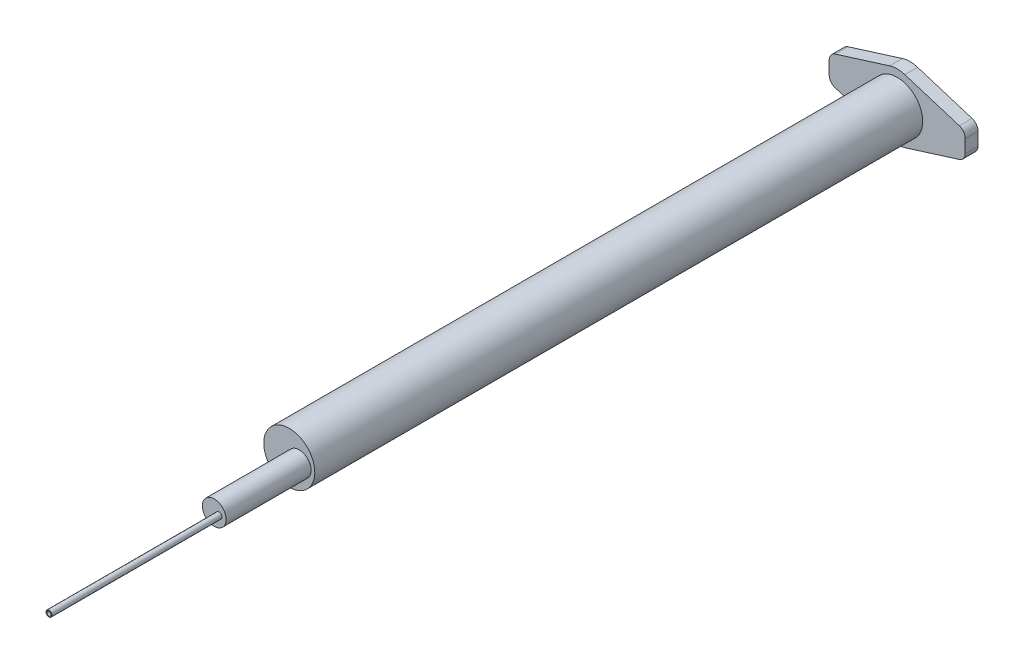
ISO-10303-21;
HEADER;
FILE_DESCRIPTION(('STEP AP214'),'2;1');
FILE_NAME('part.step','',(''),(''),'','','');
FILE_SCHEMA(('AUTOMOTIVE_DESIGN { 1 0 10303 214 1 1 1 1 }'));
ENDSEC;
DATA;
#1=APPLICATION_CONTEXT('core data for automotive mechanical design processes');
#2=APPLICATION_PROTOCOL_DEFINITION('international standard','automotive_design',2000,#1);
#3=PRODUCT_CONTEXT('',#1,'mechanical');
#4=PRODUCT('Part','Part','',(#3));
#5=PRODUCT_RELATED_PRODUCT_CATEGORY('part','',(#4));
#6=PRODUCT_DEFINITION_FORMATION('','',#4);
#7=PRODUCT_DEFINITION_CONTEXT('part definition',#1,'design');
#8=PRODUCT_DEFINITION('design','',#6,#7);
#9=PRODUCT_DEFINITION_SHAPE('','',#8);
#10=(LENGTH_UNIT() NAMED_UNIT(*) SI_UNIT(.MILLI.,.METRE.));
#11=(NAMED_UNIT(*) PLANE_ANGLE_UNIT() SI_UNIT($,.RADIAN.));
#12=(NAMED_UNIT(*) SI_UNIT($,.STERADIAN.) SOLID_ANGLE_UNIT());
#13=UNCERTAINTY_MEASURE_WITH_UNIT(LENGTH_MEASURE(1.E-05),#10,'distance_accuracy_value','');
#14=(GEOMETRIC_REPRESENTATION_CONTEXT(3) GLOBAL_UNCERTAINTY_ASSIGNED_CONTEXT((#13)) GLOBAL_UNIT_ASSIGNED_CONTEXT((#10,
#11,#12)) REPRESENTATION_CONTEXT('',''));
#15=CARTESIAN_POINT('',(0.,0.,0.));
#16=DIRECTION('',(0.,0.,1.));
#17=DIRECTION('',(1.,0.,0.));
#18=AXIS2_PLACEMENT_3D('',#15,#16,#17);
#19=CARTESIAN_POINT('',(1.17401593668525,0.,81.5));
#20=DIRECTION('',(0.,0.,1.));
#21=DIRECTION('',(1.,0.,0.));
#22=AXIS2_PLACEMENT_3D('',#19,#20,#21);
#23=PLANE('',#22);
#24=CARTESIAN_POINT('',(1.17401593668525,0.,81.5));
#25=DIRECTION('',(0.,0.,1.));
#26=DIRECTION('',(1.,0.,0.));
#27=AXIS2_PLACEMENT_3D('',#24,#25,#26);
#28=CIRCLE('',#27,1.4);
#29=CARTESIAN_POINT('',(2.57401593668525,0.,81.5));
#30=VERTEX_POINT('',#29);
#31=EDGE_CURVE('E496',#30,#30,#28,.T.);
#32=ORIENTED_EDGE('',*,*,#31,.T.);
#33=EDGE_LOOP('',(#32));
#34=FACE_BOUND('',#33,.T.);
#35=CARTESIAN_POINT('',(1.74042037950682,0.,81.5));
#36=DIRECTION('',(0.,0.,1.));
#37=DIRECTION('',(1.,0.,0.));
#38=AXIS2_PLACEMENT_3D('',#35,#36,#37);
#39=CIRCLE('',#38,0.35);
#40=CARTESIAN_POINT('',(2.09042037950682,0.,81.5));
#41=VERTEX_POINT('',#40);
#42=EDGE_CURVE('E482',#41,#41,#39,.T.);
#43=ORIENTED_EDGE('',*,*,#42,.F.);
#44=EDGE_LOOP('',(#43));
#45=FACE_BOUND('',#44,.T.);
#46=ADVANCED_FACE('F39',(#34,#45),#23,.T.);
#47=CARTESIAN_POINT('',(0.,0.,71.5));
#48=DIRECTION('',(0.,0.,1.));
#49=DIRECTION('',(1.,0.,0.));
#50=AXIS2_PLACEMENT_3D('',#47,#48,#49);
#51=PLANE('',#50);
#52=CARTESIAN_POINT('',(0.,0.,71.5));
#53=DIRECTION('',(0.,0.,1.));
#54=DIRECTION('',(1.,0.,0.));
#55=AXIS2_PLACEMENT_3D('',#52,#53,#54);
#56=CIRCLE('',#55,3.);
#57=CARTESIAN_POINT('',(3.,0.,71.5));
#58=VERTEX_POINT('',#57);
#59=EDGE_CURVE('E11',#58,#58,#56,.T.);
#60=ORIENTED_EDGE('',*,*,#59,.T.);
#61=EDGE_LOOP('',(#60));
#62=FACE_BOUND('',#61,.T.);
#63=CARTESIAN_POINT('',(1.17401593668525,0.,71.5));
#64=DIRECTION('',(0.,0.,1.));
#65=DIRECTION('',(1.,0.,0.));
#66=AXIS2_PLACEMENT_3D('',#63,#64,#65);
#67=CIRCLE('',#66,1.4);
#68=CARTESIAN_POINT('',(2.57401593668525,0.,71.5));
#69=VERTEX_POINT('',#68);
#70=EDGE_CURVE('E321',#69,#69,#67,.T.);
#71=ORIENTED_EDGE('',*,*,#70,.F.);
#72=EDGE_LOOP('',(#71));
#73=FACE_BOUND('',#72,.T.);
#74=ADVANCED_FACE('F274',(#62,#73),#51,.T.);
#75=CARTESIAN_POINT('',(0.,0.,71.5));
#76=DIRECTION('',(0.,0.,-1.));
#77=DIRECTION('',(-1.,0.,0.));
#78=AXIS2_PLACEMENT_3D('',#75,#76,#77);
#79=CYLINDRICAL_SURFACE('',#78,2.5);
#80=CARTESIAN_POINT('',(0.,0.,70.5));
#81=DIRECTION('',(0.,0.,1.));
#82=DIRECTION('',(1.,0.,0.));
#83=AXIS2_PLACEMENT_3D('',#80,#81,#82);
#84=CIRCLE('',#83,2.5);
#85=CARTESIAN_POINT('',(2.5,0.,70.5));
#86=VERTEX_POINT('',#85);
#87=EDGE_CURVE('E43',#86,#86,#84,.T.);
#88=ORIENTED_EDGE('',*,*,#87,.T.);
#89=EDGE_LOOP('',(#88));
#90=FACE_BOUND('',#89,.T.);
#91=CARTESIAN_POINT('',(0.,0.,-1.5));
#92=DIRECTION('',(0.,0.,-1.));
#93=DIRECTION('',(-1.,0.,0.));
#94=AXIS2_PLACEMENT_3D('',#91,#92,#93);
#95=CIRCLE('',#94,2.5);
#96=CARTESIAN_POINT('',(-2.5,0.,-1.5));
#97=VERTEX_POINT('',#96);
#98=EDGE_CURVE('E172',#97,#97,#95,.T.);
#99=ORIENTED_EDGE('',*,*,#98,.T.);
#100=EDGE_LOOP('',(#99));
#101=FACE_BOUND('',#100,.T.);
#102=ADVANCED_FACE('F280',(#90,#101),#79,.F.);
#103=CARTESIAN_POINT('',(0.,0.,71.5));
#104=DIRECTION('',(0.,0.,-1.));
#105=DIRECTION('',(-1.,0.,0.));
#106=AXIS2_PLACEMENT_3D('',#103,#104,#105);
#107=CYLINDRICAL_SURFACE('',#106,3.);
#108=ORIENTED_EDGE('',*,*,#59,.F.);
#109=EDGE_LOOP('',(#108));
#110=FACE_BOUND('',#109,.T.);
#111=CARTESIAN_POINT('',(0.,0.,0.));
#112=DIRECTION('',(0.,0.,1.));
#113=DIRECTION('',(1.,0.,0.));
#114=AXIS2_PLACEMENT_3D('',#111,#112,#113);
#115=CIRCLE('',#114,3.);
#116=CARTESIAN_POINT('',(3.,0.,0.));
#117=VERTEX_POINT('',#116);
#118=EDGE_CURVE('E242',#117,#117,#115,.T.);
#119=ORIENTED_EDGE('',*,*,#118,.T.);
#120=EDGE_LOOP('',(#119));
#121=FACE_BOUND('',#120,.T.);
#122=ADVANCED_FACE('F41',(#110,#121),#107,.T.);
#123=CARTESIAN_POINT('',(0.,0.,70.5));
#124=DIRECTION('',(0.,0.,1.));
#125=DIRECTION('',(1.,0.,0.));
#126=AXIS2_PLACEMENT_3D('',#123,#124,#125);
#127=PLANE('',#126);
#128=CARTESIAN_POINT('',(1.17401593668525,0.,70.5));
#129=DIRECTION('',(0.,0.,1.));
#130=DIRECTION('',(1.,0.,0.));
#131=AXIS2_PLACEMENT_3D('',#128,#129,#130);
#132=CIRCLE('',#131,1.);
#133=CARTESIAN_POINT('',(2.17401593668525,0.,70.5));
#134=VERTEX_POINT('',#133);
#135=EDGE_CURVE('E243',#134,#134,#132,.T.);
#136=ORIENTED_EDGE('',*,*,#135,.T.);
#137=EDGE_LOOP('',(#136));
#138=FACE_BOUND('',#137,.T.);
#139=ORIENTED_EDGE('',*,*,#87,.F.);
#140=EDGE_LOOP('',(#139));
#141=FACE_BOUND('',#140,.T.);
#142=ADVANCED_FACE('F296',(#138,#141),#127,.F.);
#143=CARTESIAN_POINT('',(1.17401593668525,0.,70.5));
#144=DIRECTION('',(0.,0.,1.));
#145=DIRECTION('',(1.,0.,0.));
#146=AXIS2_PLACEMENT_3D('',#143,#144,#145);
#147=CYLINDRICAL_SURFACE('',#146,1.);
#148=ORIENTED_EDGE('',*,*,#135,.F.);
#149=EDGE_LOOP('',(#148));
#150=FACE_BOUND('',#149,.T.);
#151=CARTESIAN_POINT('',(1.17401593668525,0.,80.5));
#152=DIRECTION('',(0.,0.,1.));
#153=DIRECTION('',(1.,0.,0.));
#154=AXIS2_PLACEMENT_3D('',#151,#152,#153);
#155=CIRCLE('',#154,1.);
#156=CARTESIAN_POINT('',(2.17401593668525,0.,80.5));
#157=VERTEX_POINT('',#156);
#158=EDGE_CURVE('E325',#157,#157,#155,.T.);
#159=ORIENTED_EDGE('',*,*,#158,.T.);
#160=EDGE_LOOP('',(#159));
#161=FACE_BOUND('',#160,.T.);
#162=ADVANCED_FACE('F292',(#150,#161),#147,.F.);
#163=CARTESIAN_POINT('',(0.,-0.856927259829961,-1.5));
#164=DIRECTION('',(0.,0.,1.));
#165=DIRECTION('',(1.,0.,0.));
#166=AXIS2_PLACEMENT_3D('',#163,#164,#165);
#167=PLANE('',#166);
#168=CARTESIAN_POINT('',(0.,-0.856927259829961,-1.5));
#169=DIRECTION('',(0.,0.,-1.));
#170=DIRECTION('',(1.,0.,0.));
#171=AXIS2_PLACEMENT_3D('',#168,#169,#170);
#172=CIRCLE('',#171,3.);
#173=CARTESIAN_POINT('',(0.89482497940785,-3.72036719393505,-1.5));
#174=VERTEX_POINT('',#173);
#175=CARTESIAN_POINT('',(-0.894824979407851,-3.72036719393505,-1.5));
#176=VERTEX_POINT('',#175);
#177=EDGE_CURVE('E204',#174,#176,#172,.T.);
#178=ORIENTED_EDGE('',*,*,#177,.T.);
#179=DIRECTION('',(-0.95447997803503,0.298274993135947,0.));
#180=VECTOR('',#179,1.);
#181=CARTESIAN_POINT('',(-7.29827499313594,-1.71928906464502,-1.5));
#182=LINE('',#181,#180);
#183=CARTESIAN_POINT('',(-7.29827499313594,-1.71928906464502,-1.5));
#184=VERTEX_POINT('',#183);
#185=EDGE_CURVE('E114',#176,#184,#182,.T.);
#186=ORIENTED_EDGE('',*,*,#185,.T.);
#187=CARTESIAN_POINT('',(-7.,-0.764809086609988,-1.5));
#188=DIRECTION('',(0.,0.,-1.));
#189=DIRECTION('',(-1.,0.,0.));
#190=AXIS2_PLACEMENT_3D('',#187,#188,#189);
#191=CIRCLE('',#190,1.);
#192=CARTESIAN_POINT('',(-8.,-0.764809086609988,-1.5));
#193=VERTEX_POINT('',#192);
#194=EDGE_CURVE('E333',#184,#193,#191,.T.);
#195=ORIENTED_EDGE('',*,*,#194,.T.);
#196=DIRECTION('',(0.,1.,0.));
#197=VECTOR('',#196,1.);
#198=CARTESIAN_POINT('',(-8.,0.,-1.5));
#199=LINE('',#198,#197);
#200=CARTESIAN_POINT('',(-8.,0.764809086609981,-1.5));
#201=VERTEX_POINT('',#200);
#202=EDGE_CURVE('E336',#193,#201,#199,.T.);
#203=ORIENTED_EDGE('',*,*,#202,.T.);
#204=CARTESIAN_POINT('',(-7.,0.764809086609986,-1.5));
#205=DIRECTION('',(0.,0.,-1.));
#206=DIRECTION('',(-1.,0.,0.));
#207=AXIS2_PLACEMENT_3D('',#204,#205,#206);
#208=CIRCLE('',#207,1.);
#209=CARTESIAN_POINT('',(-7.29827499313594,1.71928906464502,-1.5));
#210=VERTEX_POINT('',#209);
#211=EDGE_CURVE('E339',#201,#210,#208,.T.);
#212=ORIENTED_EDGE('',*,*,#211,.T.);
#213=DIRECTION('',(0.95447997803503,0.298274993135947,0.));
#214=VECTOR('',#213,1.);
#215=CARTESIAN_POINT('',(-7.29827499313594,1.71928906464502,-1.5));
#216=LINE('',#215,#214);
#217=CARTESIAN_POINT('',(-0.894824979407851,3.72036719393505,-1.5));
#218=VERTEX_POINT('',#217);
#219=EDGE_CURVE('E342',#210,#218,#216,.T.);
#220=ORIENTED_EDGE('',*,*,#219,.T.);
#221=CARTESIAN_POINT('',(0.,0.85692725982996,-1.5));
#222=DIRECTION('',(0.,0.,-1.));
#223=DIRECTION('',(-1.,0.,0.));
#224=AXIS2_PLACEMENT_3D('',#221,#222,#223);
#225=CIRCLE('',#224,3.);
#226=CARTESIAN_POINT('',(0.894824979407852,3.72036719393505,-1.5));
#227=VERTEX_POINT('',#226);
#228=EDGE_CURVE('E345',#218,#227,#225,.T.);
#229=ORIENTED_EDGE('',*,*,#228,.T.);
#230=DIRECTION('',(0.95447997803503,-0.298274993135947,0.));
#231=VECTOR('',#230,1.);
#232=CARTESIAN_POINT('',(7.29827499313594,1.71928906464502,-1.5));
#233=LINE('',#232,#231);
#234=CARTESIAN_POINT('',(7.29827499313594,1.71928906464502,-1.5));
#235=VERTEX_POINT('',#234);
#236=EDGE_CURVE('E348',#227,#235,#233,.T.);
#237=ORIENTED_EDGE('',*,*,#236,.T.);
#238=CARTESIAN_POINT('',(7.,0.764809086609986,-1.5));
#239=DIRECTION('',(0.,0.,-1.));
#240=DIRECTION('',(1.,0.,0.));
#241=AXIS2_PLACEMENT_3D('',#238,#239,#240);
#242=CIRCLE('',#241,1.);
#243=CARTESIAN_POINT('',(8.,0.764809086609981,-1.5));
#244=VERTEX_POINT('',#243);
#245=EDGE_CURVE('E146',#235,#244,#242,.T.);
#246=ORIENTED_EDGE('',*,*,#245,.T.);
#247=DIRECTION('',(0.,-1.,0.));
#248=VECTOR('',#247,1.);
#249=CARTESIAN_POINT('',(8.,0.764809086609981,-1.5));
#250=LINE('',#249,#248);
#251=CARTESIAN_POINT('',(8.,-0.764809086609983,-1.5));
#252=VERTEX_POINT('',#251);
#253=EDGE_CURVE('E139',#244,#252,#250,.T.);
#254=ORIENTED_EDGE('',*,*,#253,.T.);
#255=CARTESIAN_POINT('',(7.,-0.764809086609988,-1.5));
#256=DIRECTION('',(0.,0.,-1.));
#257=DIRECTION('',(1.,0.,0.));
#258=AXIS2_PLACEMENT_3D('',#255,#256,#257);
#259=CIRCLE('',#258,1.);
#260=CARTESIAN_POINT('',(7.29827499313594,-1.71928906464502,-1.5));
#261=VERTEX_POINT('',#260);
#262=EDGE_CURVE('E144',#252,#261,#259,.T.);
#263=ORIENTED_EDGE('',*,*,#262,.T.);
#264=DIRECTION('',(-0.95447997803503,-0.298274993135947,0.));
#265=VECTOR('',#264,1.);
#266=CARTESIAN_POINT('',(7.29827499313594,-1.71928906464502,-1.5));
#267=LINE('',#266,#265);
#268=EDGE_CURVE('E58',#261,#174,#267,.T.);
#269=ORIENTED_EDGE('',*,*,#268,.T.);
#270=EDGE_LOOP('',(#178,#186,#195,#203,#212,#220,#229,#237,#246,#254,#263,#269));
#271=FACE_BOUND('',#270,.T.);
#272=ORIENTED_EDGE('',*,*,#98,.F.);
#273=EDGE_LOOP('',(#272));
#274=FACE_BOUND('',#273,.T.);
#275=ADVANCED_FACE('F141',(#271,#274),#167,.F.);
#276=CARTESIAN_POINT('',(0.,-0.856927259829961,0.));
#277=DIRECTION('',(0.,0.,1.));
#278=DIRECTION('',(1.,0.,0.));
#279=AXIS2_PLACEMENT_3D('',#276,#277,#278);
#280=PLANE('',#279);
#281=ORIENTED_EDGE('',*,*,#118,.F.);
#282=EDGE_LOOP('',(#281));
#283=FACE_BOUND('',#282,.T.);
#284=CARTESIAN_POINT('',(0.,-0.856927259829961,0.));
#285=DIRECTION('',(0.,0.,-1.));
#286=DIRECTION('',(1.,0.,0.));
#287=AXIS2_PLACEMENT_3D('',#284,#285,#286);
#288=CIRCLE('',#287,3.);
#289=CARTESIAN_POINT('',(0.89482497940785,-3.72036719393505,0.));
#290=VERTEX_POINT('',#289);
#291=CARTESIAN_POINT('',(-0.894824979407851,-3.72036719393505,0.));
#292=VERTEX_POINT('',#291);
#293=EDGE_CURVE('E167',#290,#292,#288,.T.);
#294=ORIENTED_EDGE('',*,*,#293,.F.);
#295=DIRECTION('',(-0.95447997803503,-0.298274993135947,0.));
#296=VECTOR('',#295,1.);
#297=CARTESIAN_POINT('',(7.29827499313594,-1.71928906464502,0.));
#298=LINE('',#297,#296);
#299=CARTESIAN_POINT('',(7.29827499313594,-1.71928906464502,0.));
#300=VERTEX_POINT('',#299);
#301=EDGE_CURVE('E105',#300,#290,#298,.T.);
#302=ORIENTED_EDGE('',*,*,#301,.F.);
#303=CARTESIAN_POINT('',(7.,-0.764809086609988,0.));
#304=DIRECTION('',(0.,0.,-1.));
#305=DIRECTION('',(1.,0.,0.));
#306=AXIS2_PLACEMENT_3D('',#303,#304,#305);
#307=CIRCLE('',#306,1.);
#308=CARTESIAN_POINT('',(8.,-0.764809086609983,0.));
#309=VERTEX_POINT('',#308);
#310=EDGE_CURVE('E99',#309,#300,#307,.T.);
#311=ORIENTED_EDGE('',*,*,#310,.F.);
#312=DIRECTION('',(0.,-1.,0.));
#313=VECTOR('',#312,1.);
#314=CARTESIAN_POINT('',(8.,0.,0.));
#315=LINE('',#314,#313);
#316=CARTESIAN_POINT('',(8.,0.764809086609981,0.));
#317=VERTEX_POINT('',#316);
#318=EDGE_CURVE('E154',#317,#309,#315,.T.);
#319=ORIENTED_EDGE('',*,*,#318,.F.);
#320=CARTESIAN_POINT('',(7.,0.764809086609986,0.));
#321=DIRECTION('',(0.,0.,-1.));
#322=DIRECTION('',(1.,0.,0.));
#323=AXIS2_PLACEMENT_3D('',#320,#321,#322);
#324=CIRCLE('',#323,1.);
#325=CARTESIAN_POINT('',(7.29827499313594,1.71928906464502,0.));
#326=VERTEX_POINT('',#325);
#327=EDGE_CURVE('E194',#326,#317,#324,.T.);
#328=ORIENTED_EDGE('',*,*,#327,.F.);
#329=DIRECTION('',(0.95447997803503,-0.298274993135947,0.));
#330=VECTOR('',#329,1.);
#331=CARTESIAN_POINT('',(7.29827499313594,1.71928906464502,0.));
#332=LINE('',#331,#330);
#333=CARTESIAN_POINT('',(0.894824979407852,3.72036719393505,0.));
#334=VERTEX_POINT('',#333);
#335=EDGE_CURVE('E191',#334,#326,#332,.T.);
#336=ORIENTED_EDGE('',*,*,#335,.F.);
#337=CARTESIAN_POINT('',(0.,0.85692725982996,0.));
#338=DIRECTION('',(0.,0.,-1.));
#339=DIRECTION('',(-1.,0.,0.));
#340=AXIS2_PLACEMENT_3D('',#337,#338,#339);
#341=CIRCLE('',#340,3.);
#342=CARTESIAN_POINT('',(-0.894824979407851,3.72036719393505,0.));
#343=VERTEX_POINT('',#342);
#344=EDGE_CURVE('E188',#343,#334,#341,.T.);
#345=ORIENTED_EDGE('',*,*,#344,.F.);
#346=DIRECTION('',(0.95447997803503,0.298274993135947,0.));
#347=VECTOR('',#346,1.);
#348=CARTESIAN_POINT('',(-7.29827499313594,1.71928906464502,0.));
#349=LINE('',#348,#347);
#350=CARTESIAN_POINT('',(-7.29827499313594,1.71928906464502,0.));
#351=VERTEX_POINT('',#350);
#352=EDGE_CURVE('E185',#351,#343,#349,.T.);
#353=ORIENTED_EDGE('',*,*,#352,.F.);
#354=CARTESIAN_POINT('',(-7.,0.764809086609986,0.));
#355=DIRECTION('',(0.,0.,-1.));
#356=DIRECTION('',(-1.,0.,0.));
#357=AXIS2_PLACEMENT_3D('',#354,#355,#356);
#358=CIRCLE('',#357,1.);
#359=CARTESIAN_POINT('',(-8.,0.764809086609981,0.));
#360=VERTEX_POINT('',#359);
#361=EDGE_CURVE('E182',#360,#351,#358,.T.);
#362=ORIENTED_EDGE('',*,*,#361,.F.);
#363=DIRECTION('',(0.,1.,0.));
#364=VECTOR('',#363,1.);
#365=CARTESIAN_POINT('',(-8.,0.764809086609981,0.));
#366=LINE('',#365,#364);
#367=CARTESIAN_POINT('',(-8.,-0.764809086609988,0.));
#368=VERTEX_POINT('',#367);
#369=EDGE_CURVE('E179',#368,#360,#366,.T.);
#370=ORIENTED_EDGE('',*,*,#369,.F.);
#371=CARTESIAN_POINT('',(-7.,-0.764809086609988,0.));
#372=DIRECTION('',(0.,0.,-1.));
#373=DIRECTION('',(-1.,0.,0.));
#374=AXIS2_PLACEMENT_3D('',#371,#372,#373);
#375=CIRCLE('',#374,1.);
#376=CARTESIAN_POINT('',(-7.29827499313594,-1.71928906464502,0.));
#377=VERTEX_POINT('',#376);
#378=EDGE_CURVE('E175',#377,#368,#375,.T.);
#379=ORIENTED_EDGE('',*,*,#378,.F.);
#380=DIRECTION('',(-0.95447997803503,0.298274993135947,0.));
#381=VECTOR('',#380,1.);
#382=CARTESIAN_POINT('',(-7.29827499313594,-1.71928906464502,0.));
#383=LINE('',#382,#381);
#384=EDGE_CURVE('E171',#292,#377,#383,.T.);
#385=ORIENTED_EDGE('',*,*,#384,.F.);
#386=EDGE_LOOP('',(#294,#302,#311,#319,#328,#336,#345,#353,#362,#370,#379,#385));
#387=FACE_BOUND('',#386,.T.);
#388=ADVANCED_FACE('F251',(#283,#387),#280,.T.);
#389=CARTESIAN_POINT('',(0.,-0.856927259829961,-1.5));
#390=DIRECTION('',(0.,0.,1.));
#391=DIRECTION('',(1.,0.,0.));
#392=AXIS2_PLACEMENT_3D('',#389,#390,#391);
#393=CYLINDRICAL_SURFACE('',#392,3.);
#394=ORIENTED_EDGE('',*,*,#293,.T.);
#395=DIRECTION('',(0.,0.,1.));
#396=VECTOR('',#395,1.);
#397=CARTESIAN_POINT('',(-0.894824979407851,-3.72036719393505,-1.5));
#398=LINE('',#397,#396);
#399=EDGE_CURVE('E239',#176,#292,#398,.T.);
#400=ORIENTED_EDGE('',*,*,#399,.F.);
#401=ORIENTED_EDGE('',*,*,#177,.F.);
#402=DIRECTION('',(0.,0.,1.));
#403=VECTOR('',#402,1.);
#404=CARTESIAN_POINT('',(0.89482497940785,-3.72036719393505,-1.5));
#405=LINE('',#404,#403);
#406=EDGE_CURVE('E163',#174,#290,#405,.T.);
#407=ORIENTED_EDGE('',*,*,#406,.T.);
#408=EDGE_LOOP('',(#394,#400,#401,#407));
#409=FACE_BOUND('',#408,.T.);
#410=ADVANCED_FACE('F254',(#409),#393,.T.);
#411=CARTESIAN_POINT('',(-7.29827499313594,-1.71928906464502,-1.5));
#412=DIRECTION('',(0.298274993135947,0.95447997803503,0.));
#413=DIRECTION('',(-0.95447997803503,0.298274993135947,0.));
#414=AXIS2_PLACEMENT_3D('',#411,#412,#413);
#415=PLANE('',#414);
#416=ORIENTED_EDGE('',*,*,#384,.T.);
#417=DIRECTION('',(0.,0.,1.));
#418=VECTOR('',#417,1.);
#419=CARTESIAN_POINT('',(-7.29827499313594,-1.71928906464502,-1.5));
#420=LINE('',#419,#418);
#421=EDGE_CURVE('E235',#184,#377,#420,.T.);
#422=ORIENTED_EDGE('',*,*,#421,.F.);
#423=ORIENTED_EDGE('',*,*,#185,.F.);
#424=ORIENTED_EDGE('',*,*,#399,.T.);
#425=EDGE_LOOP('',(#416,#422,#423,#424));
#426=FACE_BOUND('',#425,.T.);
#427=ADVANCED_FACE('F382',(#426),#415,.F.);
#428=CARTESIAN_POINT('',(-7.,-0.764809086609988,-1.5));
#429=DIRECTION('',(0.,0.,1.));
#430=DIRECTION('',(1.,0.,0.));
#431=AXIS2_PLACEMENT_3D('',#428,#429,#430);
#432=CYLINDRICAL_SURFACE('',#431,1.);
#433=ORIENTED_EDGE('',*,*,#378,.T.);
#434=DIRECTION('',(0.,0.,1.));
#435=VECTOR('',#434,1.);
#436=CARTESIAN_POINT('',(-8.,-0.764809086609988,-1.5));
#437=LINE('',#436,#435);
#438=EDGE_CURVE('E231',#193,#368,#437,.T.);
#439=ORIENTED_EDGE('',*,*,#438,.F.);
#440=ORIENTED_EDGE('',*,*,#194,.F.);
#441=ORIENTED_EDGE('',*,*,#421,.T.);
#442=EDGE_LOOP('',(#433,#439,#440,#441));
#443=FACE_BOUND('',#442,.T.);
#444=ADVANCED_FACE('F378',(#443),#432,.T.);
#445=CARTESIAN_POINT('',(-8.,0.764809086609981,-1.5));
#446=DIRECTION('',(1.,0.,0.));
#447=DIRECTION('',(0.,0.,-1.));
#448=AXIS2_PLACEMENT_3D('',#445,#446,#447);
#449=PLANE('',#448);
#450=ORIENTED_EDGE('',*,*,#369,.T.);
#451=DIRECTION('',(0.,0.,1.));
#452=VECTOR('',#451,1.);
#453=CARTESIAN_POINT('',(-8.,0.764809086609981,-1.5));
#454=LINE('',#453,#452);
#455=EDGE_CURVE('E227',#201,#360,#454,.T.);
#456=ORIENTED_EDGE('',*,*,#455,.F.);
#457=ORIENTED_EDGE('',*,*,#202,.F.);
#458=ORIENTED_EDGE('',*,*,#438,.T.);
#459=EDGE_LOOP('',(#450,#456,#457,#458));
#460=FACE_BOUND('',#459,.T.);
#461=ADVANCED_FACE('F381',(#460),#449,.F.);
#462=CARTESIAN_POINT('',(-7.,0.764809086609986,-1.5));
#463=DIRECTION('',(0.,0.,1.));
#464=DIRECTION('',(1.,0.,0.));
#465=AXIS2_PLACEMENT_3D('',#462,#463,#464);
#466=CYLINDRICAL_SURFACE('',#465,1.);
#467=ORIENTED_EDGE('',*,*,#361,.T.);
#468=DIRECTION('',(0.,0.,1.));
#469=VECTOR('',#468,1.);
#470=CARTESIAN_POINT('',(-7.29827499313594,1.71928906464502,-1.5));
#471=LINE('',#470,#469);
#472=EDGE_CURVE('E223',#210,#351,#471,.T.);
#473=ORIENTED_EDGE('',*,*,#472,.F.);
#474=ORIENTED_EDGE('',*,*,#211,.F.);
#475=ORIENTED_EDGE('',*,*,#455,.T.);
#476=EDGE_LOOP('',(#467,#473,#474,#475));
#477=FACE_BOUND('',#476,.T.);
#478=ADVANCED_FACE('F373',(#477),#466,.T.);
#479=CARTESIAN_POINT('',(-7.29827499313594,1.71928906464502,-1.5));
#480=DIRECTION('',(0.298274993135947,-0.95447997803503,0.));
#481=DIRECTION('',(0.95447997803503,0.298274993135947,0.));
#482=AXIS2_PLACEMENT_3D('',#479,#480,#481);
#483=PLANE('',#482);
#484=ORIENTED_EDGE('',*,*,#352,.T.);
#485=DIRECTION('',(0.,0.,1.));
#486=VECTOR('',#485,1.);
#487=CARTESIAN_POINT('',(-0.894824979407851,3.72036719393505,-1.5));
#488=LINE('',#487,#486);
#489=EDGE_CURVE('E219',#218,#343,#488,.T.);
#490=ORIENTED_EDGE('',*,*,#489,.F.);
#491=ORIENTED_EDGE('',*,*,#219,.F.);
#492=ORIENTED_EDGE('',*,*,#472,.T.);
#493=EDGE_LOOP('',(#484,#490,#491,#492));
#494=FACE_BOUND('',#493,.T.);
#495=ADVANCED_FACE('F369',(#494),#483,.F.);
#496=CARTESIAN_POINT('',(0.,0.85692725982996,-1.5));
#497=DIRECTION('',(0.,0.,1.));
#498=DIRECTION('',(1.,0.,0.));
#499=AXIS2_PLACEMENT_3D('',#496,#497,#498);
#500=CYLINDRICAL_SURFACE('',#499,3.);
#501=ORIENTED_EDGE('',*,*,#344,.T.);
#502=DIRECTION('',(0.,0.,1.));
#503=VECTOR('',#502,1.);
#504=CARTESIAN_POINT('',(0.894824979407852,3.72036719393505,-1.5));
#505=LINE('',#504,#503);
#506=EDGE_CURVE('E215',#227,#334,#505,.T.);
#507=ORIENTED_EDGE('',*,*,#506,.F.);
#508=ORIENTED_EDGE('',*,*,#228,.F.);
#509=ORIENTED_EDGE('',*,*,#489,.T.);
#510=EDGE_LOOP('',(#501,#507,#508,#509));
#511=FACE_BOUND('',#510,.T.);
#512=ADVANCED_FACE('F365',(#511),#500,.T.);
#513=CARTESIAN_POINT('',(7.29827499313594,1.71928906464502,-1.5));
#514=DIRECTION('',(-0.298274993135947,-0.95447997803503,0.));
#515=DIRECTION('',(0.95447997803503,-0.298274993135947,0.));
#516=AXIS2_PLACEMENT_3D('',#513,#514,#515);
#517=PLANE('',#516);
#518=ORIENTED_EDGE('',*,*,#335,.T.);
#519=DIRECTION('',(0.,0.,1.));
#520=VECTOR('',#519,1.);
#521=CARTESIAN_POINT('',(7.29827499313594,1.71928906464502,-1.5));
#522=LINE('',#521,#520);
#523=EDGE_CURVE('E211',#235,#326,#522,.T.);
#524=ORIENTED_EDGE('',*,*,#523,.F.);
#525=ORIENTED_EDGE('',*,*,#236,.F.);
#526=ORIENTED_EDGE('',*,*,#506,.T.);
#527=EDGE_LOOP('',(#518,#524,#525,#526));
#528=FACE_BOUND('',#527,.T.);
#529=ADVANCED_FACE('F356',(#528),#517,.F.);
#530=CARTESIAN_POINT('',(7.,0.764809086609986,-1.5));
#531=DIRECTION('',(0.,0.,1.));
#532=DIRECTION('',(1.,0.,0.));
#533=AXIS2_PLACEMENT_3D('',#530,#531,#532);
#534=CYLINDRICAL_SURFACE('',#533,1.);
#535=ORIENTED_EDGE('',*,*,#327,.T.);
#536=DIRECTION('',(0.,0.,1.));
#537=VECTOR('',#536,1.);
#538=CARTESIAN_POINT('',(8.,0.764809086609981,-1.5));
#539=LINE('',#538,#537);
#540=EDGE_CURVE('E156',#244,#317,#539,.T.);
#541=ORIENTED_EDGE('',*,*,#540,.F.);
#542=ORIENTED_EDGE('',*,*,#245,.F.);
#543=ORIENTED_EDGE('',*,*,#523,.T.);
#544=EDGE_LOOP('',(#535,#541,#542,#543));
#545=FACE_BOUND('',#544,.T.);
#546=ADVANCED_FACE('F360',(#545),#534,.T.);
#547=CARTESIAN_POINT('',(8.,0.,-1.5));
#548=DIRECTION('',(-1.,0.,0.));
#549=DIRECTION('',(0.,0.,1.));
#550=AXIS2_PLACEMENT_3D('',#547,#548,#549);
#551=PLANE('',#550);
#552=ORIENTED_EDGE('',*,*,#318,.T.);
#553=DIRECTION('',(0.,0.,1.));
#554=VECTOR('',#553,1.);
#555=CARTESIAN_POINT('',(8.,-0.764809086609983,-1.5));
#556=LINE('',#555,#554);
#557=EDGE_CURVE('E152',#252,#309,#556,.T.);
#558=ORIENTED_EDGE('',*,*,#557,.F.);
#559=ORIENTED_EDGE('',*,*,#253,.F.);
#560=ORIENTED_EDGE('',*,*,#540,.T.);
#561=EDGE_LOOP('',(#552,#558,#559,#560));
#562=FACE_BOUND('',#561,.T.);
#563=ADVANCED_FACE('F153',(#562),#551,.F.);
#564=CARTESIAN_POINT('',(7.,-0.764809086609988,-1.5));
#565=DIRECTION('',(0.,0.,1.));
#566=DIRECTION('',(1.,0.,0.));
#567=AXIS2_PLACEMENT_3D('',#564,#565,#566);
#568=CYLINDRICAL_SURFACE('',#567,1.);
#569=ORIENTED_EDGE('',*,*,#310,.T.);
#570=DIRECTION('',(0.,0.,1.));
#571=VECTOR('',#570,1.);
#572=CARTESIAN_POINT('',(7.29827499313594,-1.71928906464502,-1.5));
#573=LINE('',#572,#571);
#574=EDGE_CURVE('E157',#261,#300,#573,.T.);
#575=ORIENTED_EDGE('',*,*,#574,.F.);
#576=ORIENTED_EDGE('',*,*,#262,.F.);
#577=ORIENTED_EDGE('',*,*,#557,.T.);
#578=EDGE_LOOP('',(#569,#575,#576,#577));
#579=FACE_BOUND('',#578,.T.);
#580=ADVANCED_FACE('F159',(#579),#568,.T.);
#581=CARTESIAN_POINT('',(7.29827499313594,-1.71928906464502,-1.5));
#582=DIRECTION('',(-0.298274993135947,0.95447997803503,0.));
#583=DIRECTION('',(-0.95447997803503,-0.298274993135947,0.));
#584=AXIS2_PLACEMENT_3D('',#581,#582,#583);
#585=PLANE('',#584);
#586=ORIENTED_EDGE('',*,*,#301,.T.);
#587=ORIENTED_EDGE('',*,*,#406,.F.);
#588=ORIENTED_EDGE('',*,*,#268,.F.);
#589=ORIENTED_EDGE('',*,*,#574,.T.);
#590=EDGE_LOOP('',(#586,#587,#588,#589));
#591=FACE_BOUND('',#590,.T.);
#592=ADVANCED_FACE('F261',(#591),#585,.F.);
#593=CARTESIAN_POINT('',(1.17401593668525,0.,80.5));
#594=DIRECTION('',(0.,0.,-1.));
#595=DIRECTION('',(-1.,0.,0.));
#596=AXIS2_PLACEMENT_3D('',#593,#594,#595);
#597=CYLINDRICAL_SURFACE('',#596,1.4);
#598=ORIENTED_EDGE('',*,*,#70,.T.);
#599=EDGE_LOOP('',(#598));
#600=FACE_BOUND('',#599,.T.);
#601=ORIENTED_EDGE('',*,*,#31,.F.);
#602=EDGE_LOOP('',(#601));
#603=FACE_BOUND('',#602,.T.);
#604=ADVANCED_FACE('F263',(#600,#603),#597,.T.);
#605=CARTESIAN_POINT('',(1.17401593668525,0.,80.5));
#606=DIRECTION('',(0.,0.,1.));
#607=DIRECTION('',(1.,0.,0.));
#608=AXIS2_PLACEMENT_3D('',#605,#606,#607);
#609=PLANE('',#608);
#610=CARTESIAN_POINT('',(1.74042037950682,0.,80.5));
#611=DIRECTION('',(0.,0.,1.));
#612=DIRECTION('',(1.,0.,0.));
#613=AXIS2_PLACEMENT_3D('',#610,#611,#612);
#614=CIRCLE('',#613,0.25);
#615=CARTESIAN_POINT('',(1.99042037950682,0.,80.5));
#616=VERTEX_POINT('',#615);
#617=EDGE_CURVE('E488',#616,#616,#614,.T.);
#618=ORIENTED_EDGE('',*,*,#617,.T.);
#619=EDGE_LOOP('',(#618));
#620=FACE_BOUND('',#619,.T.);
#621=ORIENTED_EDGE('',*,*,#158,.F.);
#622=EDGE_LOOP('',(#621));
#623=FACE_BOUND('',#622,.T.);
#624=ADVANCED_FACE('F270',(#620,#623),#609,.F.);
#625=CARTESIAN_POINT('',(1.74042037950682,0.,81.5));
#626=DIRECTION('',(0.,0.,-1.));
#627=DIRECTION('',(-1.,0.,0.));
#628=AXIS2_PLACEMENT_3D('',#625,#626,#627);
#629=CYLINDRICAL_SURFACE('',#628,0.25);
#630=ORIENTED_EDGE('',*,*,#617,.F.);
#631=EDGE_LOOP('',(#630));
#632=FACE_BOUND('',#631,.T.);
#633=CARTESIAN_POINT('',(1.74042037950682,0.,101.5));
#634=DIRECTION('',(0.,0.,1.));
#635=DIRECTION('',(1.,0.,0.));
#636=AXIS2_PLACEMENT_3D('',#633,#634,#635);
#637=CIRCLE('',#636,0.25);
#638=CARTESIAN_POINT('',(1.99042037950682,0.,101.5));
#639=VERTEX_POINT('',#638);
#640=EDGE_CURVE('E484',#639,#639,#637,.T.);
#641=ORIENTED_EDGE('',*,*,#640,.T.);
#642=EDGE_LOOP('',(#641));
#643=FACE_BOUND('',#642,.T.);
#644=ADVANCED_FACE('F286',(#632,#643),#629,.F.);
#645=CARTESIAN_POINT('',(1.74042037950682,0.,101.5));
#646=DIRECTION('',(0.,0.,1.));
#647=DIRECTION('',(1.,0.,0.));
#648=AXIS2_PLACEMENT_3D('',#645,#646,#647);
#649=PLANE('',#648);
#650=CARTESIAN_POINT('',(1.74042037950682,0.,101.5));
#651=DIRECTION('',(0.,0.,1.));
#652=DIRECTION('',(1.,0.,0.));
#653=AXIS2_PLACEMENT_3D('',#650,#651,#652);
#654=CIRCLE('',#653,0.35);
#655=CARTESIAN_POINT('',(2.09042037950682,0.,101.5));
#656=VERTEX_POINT('',#655);
#657=EDGE_CURVE('E479',#656,#656,#654,.T.);
#658=ORIENTED_EDGE('',*,*,#657,.T.);
#659=EDGE_LOOP('',(#658));
#660=FACE_BOUND('',#659,.T.);
#661=ORIENTED_EDGE('',*,*,#640,.F.);
#662=EDGE_LOOP('',(#661));
#663=FACE_BOUND('',#662,.T.);
#664=ADVANCED_FACE('F454',(#660,#663),#649,.T.);
#665=CARTESIAN_POINT('',(1.74042037950682,0.,101.5));
#666=DIRECTION('',(0.,0.,-1.));
#667=DIRECTION('',(-1.,0.,0.));
#668=AXIS2_PLACEMENT_3D('',#665,#666,#667);
#669=CYLINDRICAL_SURFACE('',#668,0.35);
#670=ORIENTED_EDGE('',*,*,#657,.F.);
#671=EDGE_LOOP('',(#670));
#672=FACE_BOUND('',#671,.T.);
#673=ORIENTED_EDGE('',*,*,#42,.T.);
#674=EDGE_LOOP('',(#673));
#675=FACE_BOUND('',#674,.T.);
#676=ADVANCED_FACE('F463',(#672,#675),#669,.T.);
#677=CLOSED_SHELL('',(#46,#74,#102,#122,#142,#162,#275,#388,#410,#427,#444,#461,#478,#495,#512,
#529,#546,#563,#580,#592,#604,#624,#644,#664,#676));
#678=MANIFOLD_SOLID_BREP('B2',#677);
#679=ADVANCED_BREP_SHAPE_REPRESENTATION('',(#18,#678),#14);
#680=SHAPE_DEFINITION_REPRESENTATION(#9,#679);
ENDSEC;
END-ISO-10303-21;
